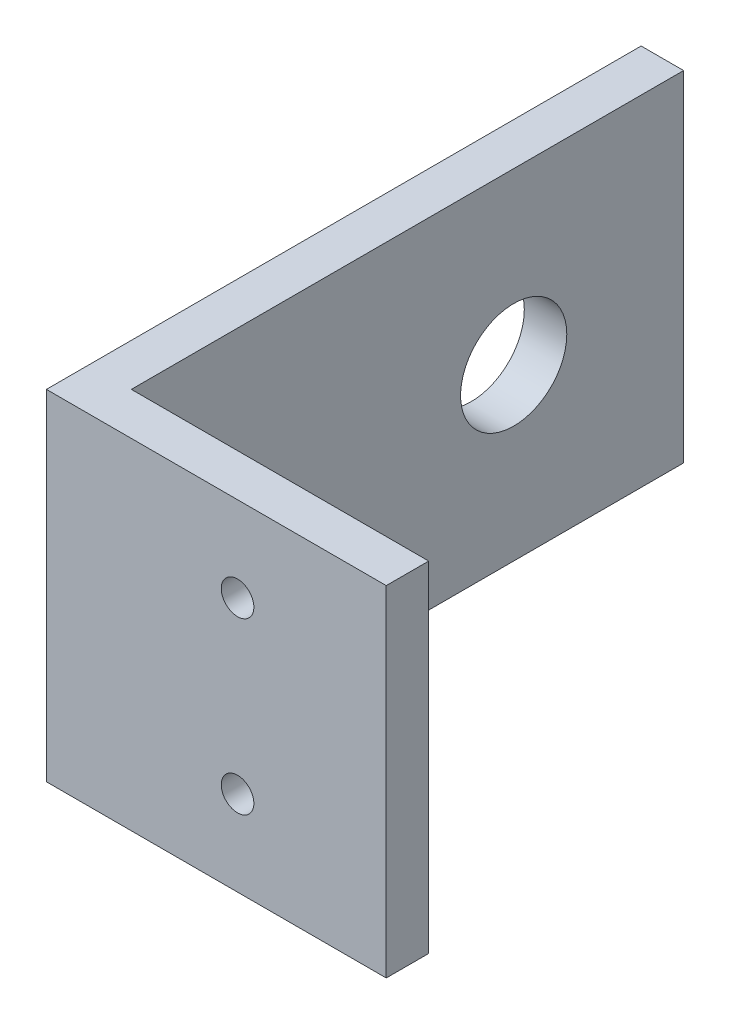
ISO-10303-21;
HEADER;
FILE_DESCRIPTION(('STEP AP214'),'2;1');
FILE_NAME('part.step','',(''),(''),'','','');
FILE_SCHEMA(('AUTOMOTIVE_DESIGN { 1 0 10303 214 1 1 1 1 }'));
ENDSEC;
DATA;
#1=APPLICATION_CONTEXT('core data for automotive mechanical design processes');
#2=APPLICATION_PROTOCOL_DEFINITION('international standard','automotive_design',2000,#1);
#3=PRODUCT_CONTEXT('',#1,'mechanical');
#4=PRODUCT('Part','Part','',(#3));
#5=PRODUCT_RELATED_PRODUCT_CATEGORY('part','',(#4));
#6=PRODUCT_DEFINITION_FORMATION('','',#4);
#7=PRODUCT_DEFINITION_CONTEXT('part definition',#1,'design');
#8=PRODUCT_DEFINITION('design','',#6,#7);
#9=PRODUCT_DEFINITION_SHAPE('','',#8);
#10=(LENGTH_UNIT() NAMED_UNIT(*) SI_UNIT(.MILLI.,.METRE.));
#11=(NAMED_UNIT(*) PLANE_ANGLE_UNIT() SI_UNIT($,.RADIAN.));
#12=(NAMED_UNIT(*) SI_UNIT($,.STERADIAN.) SOLID_ANGLE_UNIT());
#13=UNCERTAINTY_MEASURE_WITH_UNIT(LENGTH_MEASURE(1.E-05),#10,'distance_accuracy_value','');
#14=(GEOMETRIC_REPRESENTATION_CONTEXT(3) GLOBAL_UNCERTAINTY_ASSIGNED_CONTEXT((#13)) GLOBAL_UNIT_ASSIGNED_CONTEXT((#10,
#11,#12)) REPRESENTATION_CONTEXT('',''));
#15=CARTESIAN_POINT('',(0.,0.,0.));
#16=DIRECTION('',(0.,0.,1.));
#17=DIRECTION('',(1.,0.,0.));
#18=AXIS2_PLACEMENT_3D('',#15,#16,#17);
#19=CARTESIAN_POINT('',(0.,25.4,0.));
#20=DIRECTION('',(0.,0.,-1.));
#21=DIRECTION('',(-1.,0.,0.));
#22=AXIS2_PLACEMENT_3D('',#19,#20,#21);
#23=PLANE('',#22);
#24=CARTESIAN_POINT('',(14.2875,19.05,0.));
#25=DIRECTION('',(0.,0.,-1.));
#26=DIRECTION('',(-1.,0.,0.));
#27=AXIS2_PLACEMENT_3D('',#24,#25,#26);
#28=CIRCLE('',#27,1.2192);
#29=CARTESIAN_POINT('',(13.0683,19.05,0.));
#30=VERTEX_POINT('',#29);
#31=EDGE_CURVE('E163',#30,#30,#28,.T.);
#32=ORIENTED_EDGE('',*,*,#31,.T.);
#33=EDGE_LOOP('',(#32));
#34=FACE_BOUND('',#33,.T.);
#35=CARTESIAN_POINT('',(14.2875,6.35,0.));
#36=DIRECTION('',(0.,0.,-1.));
#37=DIRECTION('',(-1.,0.,0.));
#38=AXIS2_PLACEMENT_3D('',#35,#36,#37);
#39=CIRCLE('',#38,1.2192);
#40=CARTESIAN_POINT('',(13.0683,6.35,0.));
#41=VERTEX_POINT('',#40);
#42=EDGE_CURVE('E166',#41,#41,#39,.T.);
#43=ORIENTED_EDGE('',*,*,#42,.T.);
#44=EDGE_LOOP('',(#43));
#45=FACE_BOUND('',#44,.T.);
#46=DIRECTION('',(1.,0.,0.));
#47=VECTOR('',#46,1.);
#48=CARTESIAN_POINT('',(0.,0.,0.));
#49=LINE('',#48,#47);
#50=CARTESIAN_POINT('',(0.,0.,0.));
#51=VERTEX_POINT('',#50);
#52=CARTESIAN_POINT('',(25.4,0.,0.));
#53=VERTEX_POINT('',#52);
#54=EDGE_CURVE('E118',#51,#53,#49,.T.);
#55=ORIENTED_EDGE('',*,*,#54,.T.);
#56=DIRECTION('',(0.,-1.,0.));
#57=VECTOR('',#56,1.);
#58=CARTESIAN_POINT('',(25.4,25.4,0.));
#59=LINE('',#58,#57);
#60=CARTESIAN_POINT('',(25.4,25.4,0.));
#61=VERTEX_POINT('',#60);
#62=EDGE_CURVE('E11',#61,#53,#59,.T.);
#63=ORIENTED_EDGE('',*,*,#62,.F.);
#64=DIRECTION('',(1.,0.,0.));
#65=VECTOR('',#64,1.);
#66=CARTESIAN_POINT('',(0.,25.4,0.));
#67=LINE('',#66,#65);
#68=CARTESIAN_POINT('',(0.,25.4,0.));
#69=VERTEX_POINT('',#68);
#70=EDGE_CURVE('E129',#69,#61,#67,.T.);
#71=ORIENTED_EDGE('',*,*,#70,.F.);
#72=DIRECTION('',(0.,-1.,0.));
#73=VECTOR('',#72,1.);
#74=CARTESIAN_POINT('',(0.,25.4,0.));
#75=LINE('',#74,#73);
#76=EDGE_CURVE('E114',#69,#51,#75,.T.);
#77=ORIENTED_EDGE('',*,*,#76,.T.);
#78=EDGE_LOOP('',(#55,#63,#71,#77));
#79=FACE_BOUND('',#78,.T.);
#80=ADVANCED_FACE('F34',(#34,#45,#79),#23,.F.);
#81=CARTESIAN_POINT('',(25.4,25.4,0.));
#82=DIRECTION('',(-1.,0.,0.));
#83=DIRECTION('',(0.,0.,1.));
#84=AXIS2_PLACEMENT_3D('',#81,#82,#83);
#85=PLANE('',#84);
#86=DIRECTION('',(0.,0.,-1.));
#87=VECTOR('',#86,1.);
#88=CARTESIAN_POINT('',(25.4,0.,0.));
#89=LINE('',#88,#87);
#90=CARTESIAN_POINT('',(25.4,0.,-3.175));
#91=VERTEX_POINT('',#90);
#92=EDGE_CURVE('E121',#53,#91,#89,.T.);
#93=ORIENTED_EDGE('',*,*,#92,.T.);
#94=DIRECTION('',(0.,-1.,0.));
#95=VECTOR('',#94,1.);
#96=CARTESIAN_POINT('',(25.4,25.4,-3.175));
#97=LINE('',#96,#95);
#98=CARTESIAN_POINT('',(25.4,25.4,-3.175));
#99=VERTEX_POINT('',#98);
#100=EDGE_CURVE('E42',#99,#91,#97,.T.);
#101=ORIENTED_EDGE('',*,*,#100,.F.);
#102=DIRECTION('',(0.,0.,-1.));
#103=VECTOR('',#102,1.);
#104=CARTESIAN_POINT('',(25.4,25.4,0.));
#105=LINE('',#104,#103);
#106=EDGE_CURVE('E87',#61,#99,#105,.T.);
#107=ORIENTED_EDGE('',*,*,#106,.F.);
#108=ORIENTED_EDGE('',*,*,#62,.T.);
#109=EDGE_LOOP('',(#93,#101,#107,#108));
#110=FACE_BOUND('',#109,.T.);
#111=ADVANCED_FACE('F155',(#110),#85,.F.);
#112=CARTESIAN_POINT('',(3.17500000000001,25.4,-3.175));
#113=DIRECTION('',(0.,0.,1.));
#114=DIRECTION('',(1.,0.,0.));
#115=AXIS2_PLACEMENT_3D('',#112,#113,#114);
#116=PLANE('',#115);
#117=CARTESIAN_POINT('',(14.2875,19.05,-3.175));
#118=DIRECTION('',(0.,0.,-1.));
#119=DIRECTION('',(-1.,0.,0.));
#120=AXIS2_PLACEMENT_3D('',#117,#118,#119);
#121=CIRCLE('',#120,2.1844);
#122=CARTESIAN_POINT('',(12.1031,19.05,-3.175));
#123=VERTEX_POINT('',#122);
#124=EDGE_CURVE('E201',#123,#123,#121,.T.);
#125=ORIENTED_EDGE('',*,*,#124,.F.);
#126=EDGE_LOOP('',(#125));
#127=FACE_BOUND('',#126,.T.);
#128=CARTESIAN_POINT('',(14.2875,6.35,-3.175));
#129=DIRECTION('',(0.,0.,-1.));
#130=DIRECTION('',(-1.,0.,0.));
#131=AXIS2_PLACEMENT_3D('',#128,#129,#130);
#132=CIRCLE('',#131,2.1844);
#133=CARTESIAN_POINT('',(12.1031,6.35,-3.175));
#134=VERTEX_POINT('',#133);
#135=EDGE_CURVE('E174',#134,#134,#132,.T.);
#136=ORIENTED_EDGE('',*,*,#135,.F.);
#137=EDGE_LOOP('',(#136));
#138=FACE_BOUND('',#137,.T.);
#139=DIRECTION('',(-1.,0.,0.));
#140=VECTOR('',#139,1.);
#141=CARTESIAN_POINT('',(3.17500000000001,0.,-3.175));
#142=LINE('',#141,#140);
#143=CARTESIAN_POINT('',(3.17500000000001,0.,-3.175));
#144=VERTEX_POINT('',#143);
#145=EDGE_CURVE('E124',#91,#144,#142,.T.);
#146=ORIENTED_EDGE('',*,*,#145,.T.);
#147=DIRECTION('',(0.,-1.,0.));
#148=VECTOR('',#147,1.);
#149=CARTESIAN_POINT('',(3.17500000000001,25.4,-3.175));
#150=LINE('',#149,#148);
#151=CARTESIAN_POINT('',(3.17500000000001,25.4,-3.175));
#152=VERTEX_POINT('',#151);
#153=EDGE_CURVE('E109',#152,#144,#150,.T.);
#154=ORIENTED_EDGE('',*,*,#153,.F.);
#155=DIRECTION('',(-1.,0.,0.));
#156=VECTOR('',#155,1.);
#157=CARTESIAN_POINT('',(3.17500000000001,25.4,-3.175));
#158=LINE('',#157,#156);
#159=EDGE_CURVE('E100',#99,#152,#158,.T.);
#160=ORIENTED_EDGE('',*,*,#159,.F.);
#161=ORIENTED_EDGE('',*,*,#100,.T.);
#162=EDGE_LOOP('',(#146,#154,#160,#161));
#163=FACE_BOUND('',#162,.T.);
#164=ADVANCED_FACE('F135',(#127,#138,#163),#116,.F.);
#165=CARTESIAN_POINT('',(3.175,25.4,-44.45));
#166=DIRECTION('',(-1.,0.,0.));
#167=DIRECTION('',(0.,0.,1.));
#168=AXIS2_PLACEMENT_3D('',#165,#166,#167);
#169=PLANE('',#168);
#170=CARTESIAN_POINT('',(3.175,12.7,-31.75));
#171=DIRECTION('',(1.,0.,0.));
#172=DIRECTION('',(0.,0.,-1.));
#173=AXIS2_PLACEMENT_3D('',#170,#171,#172);
#174=CIRCLE('',#173,3.96875);
#175=CARTESIAN_POINT('',(3.175,12.7,-35.71875));
#176=VERTEX_POINT('',#175);
#177=EDGE_CURVE('E168',#176,#176,#174,.T.);
#178=ORIENTED_EDGE('',*,*,#177,.F.);
#179=EDGE_LOOP('',(#178));
#180=FACE_BOUND('',#179,.T.);
#181=DIRECTION('',(0.,0.,-1.));
#182=VECTOR('',#181,1.);
#183=CARTESIAN_POINT('',(3.175,0.,-44.45));
#184=LINE('',#183,#182);
#185=CARTESIAN_POINT('',(3.175,0.,-44.45));
#186=VERTEX_POINT('',#185);
#187=EDGE_CURVE('E108',#144,#186,#184,.T.);
#188=ORIENTED_EDGE('',*,*,#187,.T.);
#189=DIRECTION('',(0.,-1.,0.));
#190=VECTOR('',#189,1.);
#191=CARTESIAN_POINT('',(3.175,25.4,-44.45));
#192=LINE('',#191,#190);
#193=CARTESIAN_POINT('',(3.175,25.4,-44.45));
#194=VERTEX_POINT('',#193);
#195=EDGE_CURVE('E105',#194,#186,#192,.T.);
#196=ORIENTED_EDGE('',*,*,#195,.F.);
#197=DIRECTION('',(0.,0.,-1.));
#198=VECTOR('',#197,1.);
#199=CARTESIAN_POINT('',(3.175,25.4,-44.45));
#200=LINE('',#199,#198);
#201=EDGE_CURVE('E94',#152,#194,#200,.T.);
#202=ORIENTED_EDGE('',*,*,#201,.F.);
#203=ORIENTED_EDGE('',*,*,#153,.T.);
#204=EDGE_LOOP('',(#188,#196,#202,#203));
#205=FACE_BOUND('',#204,.T.);
#206=ADVANCED_FACE('F106',(#180,#205),#169,.F.);
#207=CARTESIAN_POINT('',(0.,25.4,-44.45));
#208=DIRECTION('',(0.,0.,1.));
#209=DIRECTION('',(1.,0.,0.));
#210=AXIS2_PLACEMENT_3D('',#207,#208,#209);
#211=PLANE('',#210);
#212=DIRECTION('',(-1.,0.,0.));
#213=VECTOR('',#212,1.);
#214=CARTESIAN_POINT('',(0.,0.,-44.45));
#215=LINE('',#214,#213);
#216=CARTESIAN_POINT('',(0.,0.,-44.45));
#217=VERTEX_POINT('',#216);
#218=EDGE_CURVE('E73',#186,#217,#215,.T.);
#219=ORIENTED_EDGE('',*,*,#218,.T.);
#220=DIRECTION('',(0.,-1.,0.));
#221=VECTOR('',#220,1.);
#222=CARTESIAN_POINT('',(0.,25.4,-44.45));
#223=LINE('',#222,#221);
#224=CARTESIAN_POINT('',(0.,25.4,-44.45));
#225=VERTEX_POINT('',#224);
#226=EDGE_CURVE('E110',#225,#217,#223,.T.);
#227=ORIENTED_EDGE('',*,*,#226,.F.);
#228=DIRECTION('',(-1.,0.,0.));
#229=VECTOR('',#228,1.);
#230=CARTESIAN_POINT('',(0.,25.4,-44.45));
#231=LINE('',#230,#229);
#232=EDGE_CURVE('E98',#194,#225,#231,.T.);
#233=ORIENTED_EDGE('',*,*,#232,.F.);
#234=ORIENTED_EDGE('',*,*,#195,.T.);
#235=EDGE_LOOP('',(#219,#227,#233,#234));
#236=FACE_BOUND('',#235,.T.);
#237=ADVANCED_FACE('F112',(#236),#211,.F.);
#238=CARTESIAN_POINT('',(0.,25.4,0.));
#239=DIRECTION('',(1.,0.,0.));
#240=DIRECTION('',(0.,0.,-1.));
#241=AXIS2_PLACEMENT_3D('',#238,#239,#240);
#242=PLANE('',#241);
#243=CARTESIAN_POINT('',(0.,12.7,-31.75));
#244=DIRECTION('',(1.,0.,0.));
#245=DIRECTION('',(0.,0.,-1.));
#246=AXIS2_PLACEMENT_3D('',#243,#244,#245);
#247=CIRCLE('',#246,3.96875);
#248=CARTESIAN_POINT('',(0.,12.7,-35.71875));
#249=VERTEX_POINT('',#248);
#250=EDGE_CURVE('E122',#249,#249,#247,.T.);
#251=ORIENTED_EDGE('',*,*,#250,.T.);
#252=EDGE_LOOP('',(#251));
#253=FACE_BOUND('',#252,.T.);
#254=DIRECTION('',(0.,0.,1.));
#255=VECTOR('',#254,1.);
#256=CARTESIAN_POINT('',(0.,0.,0.));
#257=LINE('',#256,#255);
#258=EDGE_CURVE('E79',#217,#51,#257,.T.);
#259=ORIENTED_EDGE('',*,*,#258,.T.);
#260=ORIENTED_EDGE('',*,*,#76,.F.);
#261=DIRECTION('',(0.,0.,1.));
#262=VECTOR('',#261,1.);
#263=CARTESIAN_POINT('',(0.,25.4,0.));
#264=LINE('',#263,#262);
#265=EDGE_CURVE('E50',#225,#69,#264,.T.);
#266=ORIENTED_EDGE('',*,*,#265,.F.);
#267=ORIENTED_EDGE('',*,*,#226,.T.);
#268=EDGE_LOOP('',(#259,#260,#266,#267));
#269=FACE_BOUND('',#268,.T.);
#270=ADVANCED_FACE('F142',(#253,#269),#242,.F.);
#271=CARTESIAN_POINT('',(0.,25.4,0.));
#272=DIRECTION('',(0.,1.,0.));
#273=DIRECTION('',(0.,0.,1.));
#274=AXIS2_PLACEMENT_3D('',#271,#272,#273);
#275=PLANE('',#274);
#276=ORIENTED_EDGE('',*,*,#70,.T.);
#277=ORIENTED_EDGE('',*,*,#106,.T.);
#278=ORIENTED_EDGE('',*,*,#159,.T.);
#279=ORIENTED_EDGE('',*,*,#201,.T.);
#280=ORIENTED_EDGE('',*,*,#232,.T.);
#281=ORIENTED_EDGE('',*,*,#265,.T.);
#282=EDGE_LOOP('',(#276,#277,#278,#279,#280,#281));
#283=FACE_BOUND('',#282,.T.);
#284=ADVANCED_FACE('F96',(#283),#275,.T.);
#285=CARTESIAN_POINT('',(0.,0.,0.));
#286=DIRECTION('',(0.,1.,0.));
#287=DIRECTION('',(0.,0.,1.));
#288=AXIS2_PLACEMENT_3D('',#285,#286,#287);
#289=PLANE('',#288);
#290=ORIENTED_EDGE('',*,*,#54,.F.);
#291=ORIENTED_EDGE('',*,*,#258,.F.);
#292=ORIENTED_EDGE('',*,*,#218,.F.);
#293=ORIENTED_EDGE('',*,*,#187,.F.);
#294=ORIENTED_EDGE('',*,*,#145,.F.);
#295=ORIENTED_EDGE('',*,*,#92,.F.);
#296=EDGE_LOOP('',(#290,#291,#292,#293,#294,#295));
#297=FACE_BOUND('',#296,.T.);
#298=ADVANCED_FACE('F138',(#297),#289,.F.);
#299=CARTESIAN_POINT('',(0.,12.7,-31.75));
#300=DIRECTION('',(1.,0.,0.));
#301=DIRECTION('',(0.,0.,-1.));
#302=AXIS2_PLACEMENT_3D('',#299,#300,#301);
#303=CYLINDRICAL_SURFACE('',#302,3.96875);
#304=ORIENTED_EDGE('',*,*,#250,.F.);
#305=EDGE_LOOP('',(#304));
#306=FACE_BOUND('',#305,.T.);
#307=ORIENTED_EDGE('',*,*,#177,.T.);
#308=EDGE_LOOP('',(#307));
#309=FACE_BOUND('',#308,.T.);
#310=ADVANCED_FACE('F182',(#306,#309),#303,.F.);
#311=CARTESIAN_POINT('',(14.2875,6.35,-3.175));
#312=DIRECTION('',(0.,0.,-1.));
#313=DIRECTION('',(-1.,0.,0.));
#314=AXIS2_PLACEMENT_3D('',#311,#312,#313);
#315=CYLINDRICAL_SURFACE('',#314,1.21919999999999);
#316=ORIENTED_EDGE('',*,*,#42,.F.);
#317=EDGE_LOOP('',(#316));
#318=FACE_BOUND('',#317,.T.);
#319=CARTESIAN_POINT('',(14.2875,6.35,-2.06466441335028));
#320=DIRECTION('',(0.,0.,-1.));
#321=DIRECTION('',(-1.,0.,0.));
#322=AXIS2_PLACEMENT_3D('',#319,#320,#321);
#323=CIRCLE('',#322,1.21919999999999);
#324=CARTESIAN_POINT('',(13.0683,6.35,-2.06466441335028));
#325=VERTEX_POINT('',#324);
#326=EDGE_CURVE('E169',#325,#325,#323,.T.);
#327=ORIENTED_EDGE('',*,*,#326,.T.);
#328=EDGE_LOOP('',(#327));
#329=FACE_BOUND('',#328,.T.);
#330=ADVANCED_FACE('F185',(#318,#329),#315,.F.);
#331=CARTESIAN_POINT('',(14.2875,6.35,-3.175));
#332=DIRECTION('',(0.,0.,-1.));
#333=DIRECTION('',(-1.,0.,0.));
#334=AXIS2_PLACEMENT_3D('',#331,#332,#333);
#335=CONICAL_SURFACE('',#334,2.1844,0.71558499331768);
#336=ORIENTED_EDGE('',*,*,#326,.F.);
#337=EDGE_LOOP('',(#336));
#338=FACE_BOUND('',#337,.T.);
#339=ORIENTED_EDGE('',*,*,#135,.T.);
#340=EDGE_LOOP('',(#339));
#341=FACE_BOUND('',#340,.T.);
#342=ADVANCED_FACE('F219',(#338,#341),#335,.F.);
#343=CARTESIAN_POINT('',(14.2875,19.05,-3.175));
#344=DIRECTION('',(0.,0.,-1.));
#345=DIRECTION('',(-1.,0.,0.));
#346=AXIS2_PLACEMENT_3D('',#343,#344,#345);
#347=CYLINDRICAL_SURFACE('',#346,1.21919999999999);
#348=ORIENTED_EDGE('',*,*,#31,.F.);
#349=EDGE_LOOP('',(#348));
#350=FACE_BOUND('',#349,.T.);
#351=CARTESIAN_POINT('',(14.2875,19.05,-2.06466441335028));
#352=DIRECTION('',(0.,0.,-1.));
#353=DIRECTION('',(-1.,0.,0.));
#354=AXIS2_PLACEMENT_3D('',#351,#352,#353);
#355=CIRCLE('',#354,1.21919999999999);
#356=CARTESIAN_POINT('',(13.0683,19.05,-2.06466441335028));
#357=VERTEX_POINT('',#356);
#358=EDGE_CURVE('E205',#357,#357,#355,.T.);
#359=ORIENTED_EDGE('',*,*,#358,.T.);
#360=EDGE_LOOP('',(#359));
#361=FACE_BOUND('',#360,.T.);
#362=ADVANCED_FACE('F213',(#350,#361),#347,.F.);
#363=CARTESIAN_POINT('',(14.2875,19.05,-3.175));
#364=DIRECTION('',(0.,0.,-1.));
#365=DIRECTION('',(-1.,0.,0.));
#366=AXIS2_PLACEMENT_3D('',#363,#364,#365);
#367=CONICAL_SURFACE('',#366,2.1844,0.71558499331768);
#368=ORIENTED_EDGE('',*,*,#358,.F.);
#369=EDGE_LOOP('',(#368));
#370=FACE_BOUND('',#369,.T.);
#371=ORIENTED_EDGE('',*,*,#124,.T.);
#372=EDGE_LOOP('',(#371));
#373=FACE_BOUND('',#372,.T.);
#374=ADVANCED_FACE('F211',(#370,#373),#367,.F.);
#375=CLOSED_SHELL('',(#80,#111,#164,#206,#237,#270,#284,#298,#310,#330,#342,#362,#374));
#376=MANIFOLD_SOLID_BREP('B2',#375);
#377=ADVANCED_BREP_SHAPE_REPRESENTATION('',(#18,#376),#14);
#378=SHAPE_DEFINITION_REPRESENTATION(#9,#377);
ENDSEC;
END-ISO-10303-21;
